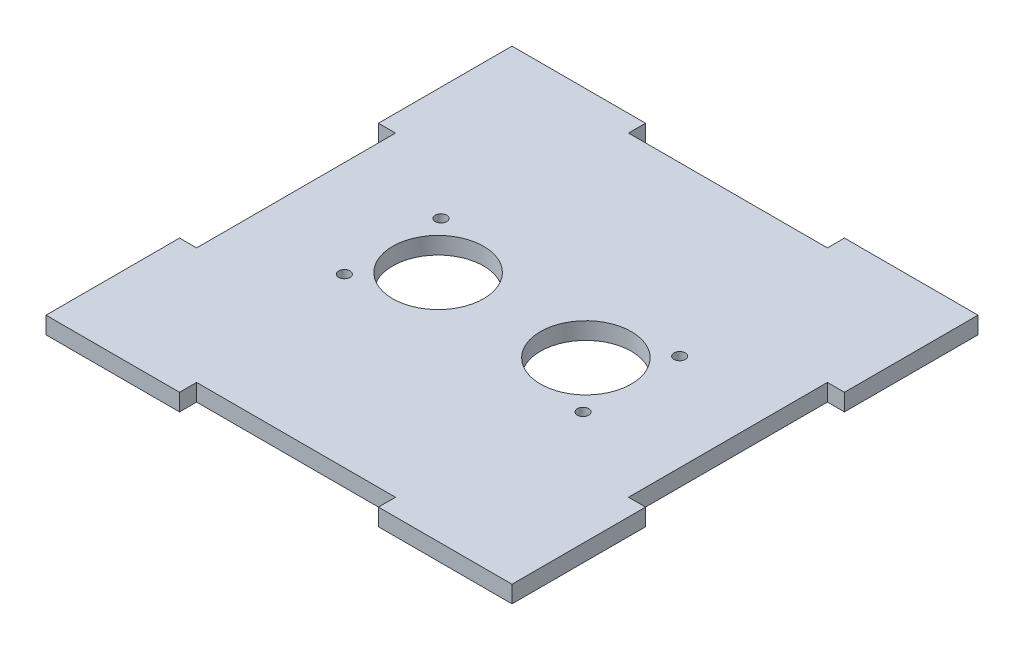
ISO-10303-21;
HEADER;
FILE_DESCRIPTION(('STEP AP214'),'2;1');
FILE_NAME('part.step','',(''),(''),'','','');
FILE_SCHEMA(('AUTOMOTIVE_DESIGN { 1 0 10303 214 1 1 1 1 }'));
ENDSEC;
DATA;
#1=APPLICATION_CONTEXT('core data for automotive mechanical design processes');
#2=APPLICATION_PROTOCOL_DEFINITION('international standard','automotive_design',2000,#1);
#3=PRODUCT_CONTEXT('',#1,'mechanical');
#4=PRODUCT('Part','Part','',(#3));
#5=PRODUCT_RELATED_PRODUCT_CATEGORY('part','',(#4));
#6=PRODUCT_DEFINITION_FORMATION('','',#4);
#7=PRODUCT_DEFINITION_CONTEXT('part definition',#1,'design');
#8=PRODUCT_DEFINITION('design','',#6,#7);
#9=PRODUCT_DEFINITION_SHAPE('','',#8);
#10=(LENGTH_UNIT() NAMED_UNIT(*) SI_UNIT(.MILLI.,.METRE.));
#11=(NAMED_UNIT(*) PLANE_ANGLE_UNIT() SI_UNIT($,.RADIAN.));
#12=(NAMED_UNIT(*) SI_UNIT($,.STERADIAN.) SOLID_ANGLE_UNIT());
#13=UNCERTAINTY_MEASURE_WITH_UNIT(LENGTH_MEASURE(1.E-05),#10,'distance_accuracy_value','');
#14=(GEOMETRIC_REPRESENTATION_CONTEXT(3) GLOBAL_UNCERTAINTY_ASSIGNED_CONTEXT((#13)) GLOBAL_UNIT_ASSIGNED_CONTEXT((#10,
#11,#12)) REPRESENTATION_CONTEXT('',''));
#15=CARTESIAN_POINT('',(0.,0.,0.));
#16=DIRECTION('',(0.,0.,1.));
#17=DIRECTION('',(1.,0.,0.));
#18=AXIS2_PLACEMENT_3D('',#15,#16,#17);
#19=CARTESIAN_POINT('',(41.,3.,-17.5));
#20=DIRECTION('',(-1.,0.,0.));
#21=DIRECTION('',(0.,0.,1.));
#22=AXIS2_PLACEMENT_3D('',#19,#20,#21);
#23=PLANE('',#22);
#24=DIRECTION('',(0.,0.,-1.));
#25=VECTOR('',#24,1.);
#26=CARTESIAN_POINT('',(41.,0.,-17.5));
#27=LINE('',#26,#25);
#28=CARTESIAN_POINT('',(41.,0.,-17.5));
#29=VERTEX_POINT('',#28);
#30=CARTESIAN_POINT('',(41.,0.,-41.));
#31=VERTEX_POINT('',#30);
#32=EDGE_CURVE('E204',#29,#31,#27,.T.);
#33=ORIENTED_EDGE('',*,*,#32,.T.);
#34=DIRECTION('',(0.,-1.,0.));
#35=VECTOR('',#34,1.);
#36=CARTESIAN_POINT('',(41.,3.,-41.));
#37=LINE('',#36,#35);
#38=CARTESIAN_POINT('',(41.,3.,-41.));
#39=VERTEX_POINT('',#38);
#40=EDGE_CURVE('E11',#39,#31,#37,.T.);
#41=ORIENTED_EDGE('',*,*,#40,.F.);
#42=DIRECTION('',(0.,0.,-1.));
#43=VECTOR('',#42,1.);
#44=CARTESIAN_POINT('',(41.,3.,-17.5));
#45=LINE('',#44,#43);
#46=CARTESIAN_POINT('',(41.,3.,-17.5));
#47=VERTEX_POINT('',#46);
#48=EDGE_CURVE('E243',#47,#39,#45,.T.);
#49=ORIENTED_EDGE('',*,*,#48,.F.);
#50=DIRECTION('',(0.,-1.,0.));
#51=VECTOR('',#50,1.);
#52=CARTESIAN_POINT('',(41.,3.,-17.5));
#53=LINE('',#52,#51);
#54=EDGE_CURVE('E200',#47,#29,#53,.T.);
#55=ORIENTED_EDGE('',*,*,#54,.T.);
#56=EDGE_LOOP('',(#33,#41,#49,#55));
#57=FACE_BOUND('',#56,.T.);
#58=ADVANCED_FACE('F36',(#57),#23,.F.);
#59=CARTESIAN_POINT('',(17.5,3.,-41.));
#60=DIRECTION('',(0.,0.,1.));
#61=DIRECTION('',(1.,0.,0.));
#62=AXIS2_PLACEMENT_3D('',#59,#60,#61);
#63=PLANE('',#62);
#64=DIRECTION('',(-1.,0.,0.));
#65=VECTOR('',#64,1.);
#66=CARTESIAN_POINT('',(17.5,0.,-41.));
#67=LINE('',#66,#65);
#68=CARTESIAN_POINT('',(17.5,0.,-41.));
#69=VERTEX_POINT('',#68);
#70=EDGE_CURVE('E207',#31,#69,#67,.T.);
#71=ORIENTED_EDGE('',*,*,#70,.T.);
#72=DIRECTION('',(0.,-1.,0.));
#73=VECTOR('',#72,1.);
#74=CARTESIAN_POINT('',(17.5,3.,-41.));
#75=LINE('',#74,#73);
#76=CARTESIAN_POINT('',(17.5,3.,-41.));
#77=VERTEX_POINT('',#76);
#78=EDGE_CURVE('E44',#77,#69,#75,.T.);
#79=ORIENTED_EDGE('',*,*,#78,.F.);
#80=DIRECTION('',(-1.,0.,0.));
#81=VECTOR('',#80,1.);
#82=CARTESIAN_POINT('',(17.5,3.,-41.));
#83=LINE('',#82,#81);
#84=EDGE_CURVE('E131',#39,#77,#83,.T.);
#85=ORIENTED_EDGE('',*,*,#84,.F.);
#86=ORIENTED_EDGE('',*,*,#40,.T.);
#87=EDGE_LOOP('',(#71,#79,#85,#86));
#88=FACE_BOUND('',#87,.T.);
#89=ADVANCED_FACE('F362',(#88),#63,.F.);
#90=CARTESIAN_POINT('',(17.5,3.,-38.));
#91=DIRECTION('',(1.,0.,0.));
#92=DIRECTION('',(0.,0.,-1.));
#93=AXIS2_PLACEMENT_3D('',#90,#91,#92);
#94=PLANE('',#93);
#95=DIRECTION('',(0.,0.,1.));
#96=VECTOR('',#95,1.);
#97=CARTESIAN_POINT('',(17.5,0.,-38.));
#98=LINE('',#97,#96);
#99=CARTESIAN_POINT('',(17.5,0.,-38.));
#100=VERTEX_POINT('',#99);
#101=EDGE_CURVE('E210',#69,#100,#98,.T.);
#102=ORIENTED_EDGE('',*,*,#101,.T.);
#103=DIRECTION('',(0.,-1.,0.));
#104=VECTOR('',#103,1.);
#105=CARTESIAN_POINT('',(17.5,3.,-38.));
#106=LINE('',#105,#104);
#107=CARTESIAN_POINT('',(17.5,3.,-38.));
#108=VERTEX_POINT('',#107);
#109=EDGE_CURVE('E286',#108,#100,#106,.T.);
#110=ORIENTED_EDGE('',*,*,#109,.F.);
#111=DIRECTION('',(0.,0.,1.));
#112=VECTOR('',#111,1.);
#113=CARTESIAN_POINT('',(17.5,3.,-38.));
#114=LINE('',#113,#112);
#115=EDGE_CURVE('E294',#77,#108,#114,.T.);
#116=ORIENTED_EDGE('',*,*,#115,.F.);
#117=ORIENTED_EDGE('',*,*,#78,.T.);
#118=EDGE_LOOP('',(#102,#110,#116,#117));
#119=FACE_BOUND('',#118,.T.);
#120=ADVANCED_FACE('F292',(#119),#94,.F.);
#121=CARTESIAN_POINT('',(-17.5,3.,-38.));
#122=DIRECTION('',(0.,0.,1.));
#123=DIRECTION('',(1.,0.,0.));
#124=AXIS2_PLACEMENT_3D('',#121,#122,#123);
#125=PLANE('',#124);
#126=DIRECTION('',(-1.,0.,0.));
#127=VECTOR('',#126,1.);
#128=CARTESIAN_POINT('',(-17.5,0.,-38.));
#129=LINE('',#128,#127);
#130=CARTESIAN_POINT('',(-17.5,0.,-38.));
#131=VERTEX_POINT('',#130);
#132=EDGE_CURVE('E212',#100,#131,#129,.T.);
#133=ORIENTED_EDGE('',*,*,#132,.T.);
#134=DIRECTION('',(0.,-1.,0.));
#135=VECTOR('',#134,1.);
#136=CARTESIAN_POINT('',(-17.5,3.,-38.));
#137=LINE('',#136,#135);
#138=CARTESIAN_POINT('',(-17.5,3.,-38.));
#139=VERTEX_POINT('',#138);
#140=EDGE_CURVE('E283',#139,#131,#137,.T.);
#141=ORIENTED_EDGE('',*,*,#140,.F.);
#142=DIRECTION('',(-1.,0.,0.));
#143=VECTOR('',#142,1.);
#144=CARTESIAN_POINT('',(-17.5,3.,-38.));
#145=LINE('',#144,#143);
#146=EDGE_CURVE('E312',#108,#139,#145,.T.);
#147=ORIENTED_EDGE('',*,*,#146,.F.);
#148=ORIENTED_EDGE('',*,*,#109,.T.);
#149=EDGE_LOOP('',(#133,#141,#147,#148));
#150=FACE_BOUND('',#149,.T.);
#151=ADVANCED_FACE('F303',(#150),#125,.F.);
#152=CARTESIAN_POINT('',(-17.5,3.,-41.));
#153=DIRECTION('',(-1.,0.,0.));
#154=DIRECTION('',(0.,0.,1.));
#155=AXIS2_PLACEMENT_3D('',#152,#153,#154);
#156=PLANE('',#155);
#157=DIRECTION('',(0.,0.,-1.));
#158=VECTOR('',#157,1.);
#159=CARTESIAN_POINT('',(-17.5,0.,-41.));
#160=LINE('',#159,#158);
#161=CARTESIAN_POINT('',(-17.5,0.,-41.));
#162=VERTEX_POINT('',#161);
#163=EDGE_CURVE('E214',#131,#162,#160,.T.);
#164=ORIENTED_EDGE('',*,*,#163,.T.);
#165=DIRECTION('',(0.,-1.,0.));
#166=VECTOR('',#165,1.);
#167=CARTESIAN_POINT('',(-17.5,3.,-41.));
#168=LINE('',#167,#166);
#169=CARTESIAN_POINT('',(-17.5,3.,-41.));
#170=VERTEX_POINT('',#169);
#171=EDGE_CURVE('E280',#170,#162,#168,.T.);
#172=ORIENTED_EDGE('',*,*,#171,.F.);
#173=DIRECTION('',(0.,0.,-1.));
#174=VECTOR('',#173,1.);
#175=CARTESIAN_POINT('',(-17.5,3.,-41.));
#176=LINE('',#175,#174);
#177=EDGE_CURVE('E309',#139,#170,#176,.T.);
#178=ORIENTED_EDGE('',*,*,#177,.F.);
#179=ORIENTED_EDGE('',*,*,#140,.T.);
#180=EDGE_LOOP('',(#164,#172,#178,#179));
#181=FACE_BOUND('',#180,.T.);
#182=ADVANCED_FACE('F307',(#181),#156,.F.);
#183=CARTESIAN_POINT('',(-41.,3.,-41.));
#184=DIRECTION('',(0.,0.,1.));
#185=DIRECTION('',(1.,0.,0.));
#186=AXIS2_PLACEMENT_3D('',#183,#184,#185);
#187=PLANE('',#186);
#188=DIRECTION('',(-1.,0.,0.));
#189=VECTOR('',#188,1.);
#190=CARTESIAN_POINT('',(-41.,0.,-41.));
#191=LINE('',#190,#189);
#192=CARTESIAN_POINT('',(-41.,0.,-41.));
#193=VERTEX_POINT('',#192);
#194=EDGE_CURVE('E216',#162,#193,#191,.T.);
#195=ORIENTED_EDGE('',*,*,#194,.T.);
#196=DIRECTION('',(0.,-1.,0.));
#197=VECTOR('',#196,1.);
#198=CARTESIAN_POINT('',(-41.,3.,-41.));
#199=LINE('',#198,#197);
#200=CARTESIAN_POINT('',(-41.,3.,-41.));
#201=VERTEX_POINT('',#200);
#202=EDGE_CURVE('E277',#201,#193,#199,.T.);
#203=ORIENTED_EDGE('',*,*,#202,.F.);
#204=DIRECTION('',(-1.,0.,0.));
#205=VECTOR('',#204,1.);
#206=CARTESIAN_POINT('',(-41.,3.,-41.));
#207=LINE('',#206,#205);
#208=EDGE_CURVE('E311',#170,#201,#207,.T.);
#209=ORIENTED_EDGE('',*,*,#208,.F.);
#210=ORIENTED_EDGE('',*,*,#171,.T.);
#211=EDGE_LOOP('',(#195,#203,#209,#210));
#212=FACE_BOUND('',#211,.T.);
#213=ADVANCED_FACE('F375',(#212),#187,.F.);
#214=CARTESIAN_POINT('',(-41.,3.,-17.5));
#215=DIRECTION('',(1.,0.,0.));
#216=DIRECTION('',(0.,0.,-1.));
#217=AXIS2_PLACEMENT_3D('',#214,#215,#216);
#218=PLANE('',#217);
#219=DIRECTION('',(0.,0.,1.));
#220=VECTOR('',#219,1.);
#221=CARTESIAN_POINT('',(-41.,0.,-17.5));
#222=LINE('',#221,#220);
#223=CARTESIAN_POINT('',(-41.,0.,-17.5));
#224=VERTEX_POINT('',#223);
#225=EDGE_CURVE('E218',#193,#224,#222,.T.);
#226=ORIENTED_EDGE('',*,*,#225,.T.);
#227=DIRECTION('',(0.,-1.,0.));
#228=VECTOR('',#227,1.);
#229=CARTESIAN_POINT('',(-41.,3.,-17.5));
#230=LINE('',#229,#228);
#231=CARTESIAN_POINT('',(-41.,3.,-17.5));
#232=VERTEX_POINT('',#231);
#233=EDGE_CURVE('E274',#232,#224,#230,.T.);
#234=ORIENTED_EDGE('',*,*,#233,.F.);
#235=DIRECTION('',(0.,0.,1.));
#236=VECTOR('',#235,1.);
#237=CARTESIAN_POINT('',(-41.,3.,-17.5));
#238=LINE('',#237,#236);
#239=EDGE_CURVE('E314',#201,#232,#238,.T.);
#240=ORIENTED_EDGE('',*,*,#239,.F.);
#241=ORIENTED_EDGE('',*,*,#202,.T.);
#242=EDGE_LOOP('',(#226,#234,#240,#241));
#243=FACE_BOUND('',#242,.T.);
#244=ADVANCED_FACE('F378',(#243),#218,.F.);
#245=CARTESIAN_POINT('',(-41.,3.,-17.5));
#246=DIRECTION('',(0.,0.,-1.));
#247=DIRECTION('',(-1.,0.,0.));
#248=AXIS2_PLACEMENT_3D('',#245,#246,#247);
#249=PLANE('',#248);
#250=DIRECTION('',(1.,0.,0.));
#251=VECTOR('',#250,1.);
#252=CARTESIAN_POINT('',(-41.,0.,-17.5));
#253=LINE('',#252,#251);
#254=CARTESIAN_POINT('',(-38.,0.,-17.5));
#255=VERTEX_POINT('',#254);
#256=EDGE_CURVE('E220',#224,#255,#253,.T.);
#257=ORIENTED_EDGE('',*,*,#256,.T.);
#258=DIRECTION('',(0.,-1.,0.));
#259=VECTOR('',#258,1.);
#260=CARTESIAN_POINT('',(-38.,3.,-17.5));
#261=LINE('',#260,#259);
#262=CARTESIAN_POINT('',(-38.,3.,-17.5));
#263=VERTEX_POINT('',#262);
#264=EDGE_CURVE('E271',#263,#255,#261,.T.);
#265=ORIENTED_EDGE('',*,*,#264,.F.);
#266=DIRECTION('',(1.,0.,0.));
#267=VECTOR('',#266,1.);
#268=CARTESIAN_POINT('',(-41.,3.,-17.5));
#269=LINE('',#268,#267);
#270=EDGE_CURVE('E320',#232,#263,#269,.T.);
#271=ORIENTED_EDGE('',*,*,#270,.F.);
#272=ORIENTED_EDGE('',*,*,#233,.T.);
#273=EDGE_LOOP('',(#257,#265,#271,#272));
#274=FACE_BOUND('',#273,.T.);
#275=ADVANCED_FACE('F382',(#274),#249,.F.);
#276=CARTESIAN_POINT('',(-38.,3.,-17.5));
#277=DIRECTION('',(1.,0.,0.));
#278=DIRECTION('',(0.,0.,-1.));
#279=AXIS2_PLACEMENT_3D('',#276,#277,#278);
#280=PLANE('',#279);
#281=DIRECTION('',(0.,0.,1.));
#282=VECTOR('',#281,1.);
#283=CARTESIAN_POINT('',(-38.,0.,-17.5));
#284=LINE('',#283,#282);
#285=CARTESIAN_POINT('',(-38.,0.,17.5));
#286=VERTEX_POINT('',#285);
#287=EDGE_CURVE('E222',#255,#286,#284,.T.);
#288=ORIENTED_EDGE('',*,*,#287,.T.);
#289=DIRECTION('',(0.,-1.,0.));
#290=VECTOR('',#289,1.);
#291=CARTESIAN_POINT('',(-38.,3.,17.5));
#292=LINE('',#291,#290);
#293=CARTESIAN_POINT('',(-38.,3.,17.5));
#294=VERTEX_POINT('',#293);
#295=EDGE_CURVE('E268',#294,#286,#292,.T.);
#296=ORIENTED_EDGE('',*,*,#295,.F.);
#297=DIRECTION('',(0.,0.,1.));
#298=VECTOR('',#297,1.);
#299=CARTESIAN_POINT('',(-38.,3.,-17.5));
#300=LINE('',#299,#298);
#301=EDGE_CURVE('E322',#263,#294,#300,.T.);
#302=ORIENTED_EDGE('',*,*,#301,.F.);
#303=ORIENTED_EDGE('',*,*,#264,.T.);
#304=EDGE_LOOP('',(#288,#296,#302,#303));
#305=FACE_BOUND('',#304,.T.);
#306=ADVANCED_FACE('F386',(#305),#280,.F.);
#307=CARTESIAN_POINT('',(-38.,3.,17.5));
#308=DIRECTION('',(0.,0.,1.));
#309=DIRECTION('',(1.,0.,0.));
#310=AXIS2_PLACEMENT_3D('',#307,#308,#309);
#311=PLANE('',#310);
#312=DIRECTION('',(-1.,0.,0.));
#313=VECTOR('',#312,1.);
#314=CARTESIAN_POINT('',(-38.,0.,17.5));
#315=LINE('',#314,#313);
#316=CARTESIAN_POINT('',(-41.,0.,17.5));
#317=VERTEX_POINT('',#316);
#318=EDGE_CURVE('E224',#286,#317,#315,.T.);
#319=ORIENTED_EDGE('',*,*,#318,.T.);
#320=DIRECTION('',(0.,-1.,0.));
#321=VECTOR('',#320,1.);
#322=CARTESIAN_POINT('',(-41.,3.,17.5));
#323=LINE('',#322,#321);
#324=CARTESIAN_POINT('',(-41.,3.,17.5));
#325=VERTEX_POINT('',#324);
#326=EDGE_CURVE('E265',#325,#317,#323,.T.);
#327=ORIENTED_EDGE('',*,*,#326,.F.);
#328=DIRECTION('',(-1.,0.,0.));
#329=VECTOR('',#328,1.);
#330=CARTESIAN_POINT('',(-38.,3.,17.5));
#331=LINE('',#330,#329);
#332=EDGE_CURVE('E324',#294,#325,#331,.T.);
#333=ORIENTED_EDGE('',*,*,#332,.F.);
#334=ORIENTED_EDGE('',*,*,#295,.T.);
#335=EDGE_LOOP('',(#319,#327,#333,#334));
#336=FACE_BOUND('',#335,.T.);
#337=ADVANCED_FACE('F390',(#336),#311,.F.);
#338=CARTESIAN_POINT('',(-41.,3.,41.));
#339=DIRECTION('',(1.,0.,0.));
#340=DIRECTION('',(0.,0.,-1.));
#341=AXIS2_PLACEMENT_3D('',#338,#339,#340);
#342=PLANE('',#341);
#343=DIRECTION('',(0.,0.,1.));
#344=VECTOR('',#343,1.);
#345=CARTESIAN_POINT('',(-41.,0.,41.));
#346=LINE('',#345,#344);
#347=CARTESIAN_POINT('',(-41.,0.,41.));
#348=VERTEX_POINT('',#347);
#349=EDGE_CURVE('E226',#317,#348,#346,.T.);
#350=ORIENTED_EDGE('',*,*,#349,.T.);
#351=DIRECTION('',(0.,-1.,0.));
#352=VECTOR('',#351,1.);
#353=CARTESIAN_POINT('',(-41.,3.,41.));
#354=LINE('',#353,#352);
#355=CARTESIAN_POINT('',(-41.,3.,41.));
#356=VERTEX_POINT('',#355);
#357=EDGE_CURVE('E262',#356,#348,#354,.T.);
#358=ORIENTED_EDGE('',*,*,#357,.F.);
#359=DIRECTION('',(0.,0.,1.));
#360=VECTOR('',#359,1.);
#361=CARTESIAN_POINT('',(-41.,3.,41.));
#362=LINE('',#361,#360);
#363=EDGE_CURVE('E326',#325,#356,#362,.T.);
#364=ORIENTED_EDGE('',*,*,#363,.F.);
#365=ORIENTED_EDGE('',*,*,#326,.T.);
#366=EDGE_LOOP('',(#350,#358,#364,#365));
#367=FACE_BOUND('',#366,.T.);
#368=ADVANCED_FACE('F394',(#367),#342,.F.);
#369=CARTESIAN_POINT('',(-41.,3.,41.));
#370=DIRECTION('',(0.,0.,-1.));
#371=DIRECTION('',(-1.,0.,0.));
#372=AXIS2_PLACEMENT_3D('',#369,#370,#371);
#373=PLANE('',#372);
#374=DIRECTION('',(1.,0.,0.));
#375=VECTOR('',#374,1.);
#376=CARTESIAN_POINT('',(-41.,0.,41.));
#377=LINE('',#376,#375);
#378=CARTESIAN_POINT('',(-17.5,0.,41.));
#379=VERTEX_POINT('',#378);
#380=EDGE_CURVE('E228',#348,#379,#377,.T.);
#381=ORIENTED_EDGE('',*,*,#380,.T.);
#382=DIRECTION('',(0.,-1.,0.));
#383=VECTOR('',#382,1.);
#384=CARTESIAN_POINT('',(-17.5,3.,41.));
#385=LINE('',#384,#383);
#386=CARTESIAN_POINT('',(-17.5,3.,41.));
#387=VERTEX_POINT('',#386);
#388=EDGE_CURVE('E259',#387,#379,#385,.T.);
#389=ORIENTED_EDGE('',*,*,#388,.F.);
#390=DIRECTION('',(1.,0.,0.));
#391=VECTOR('',#390,1.);
#392=CARTESIAN_POINT('',(-41.,3.,41.));
#393=LINE('',#392,#391);
#394=EDGE_CURVE('E328',#356,#387,#393,.T.);
#395=ORIENTED_EDGE('',*,*,#394,.F.);
#396=ORIENTED_EDGE('',*,*,#357,.T.);
#397=EDGE_LOOP('',(#381,#389,#395,#396));
#398=FACE_BOUND('',#397,.T.);
#399=ADVANCED_FACE('F398',(#398),#373,.F.);
#400=CARTESIAN_POINT('',(-17.5,3.,38.));
#401=DIRECTION('',(-1.,0.,0.));
#402=DIRECTION('',(0.,0.,1.));
#403=AXIS2_PLACEMENT_3D('',#400,#401,#402);
#404=PLANE('',#403);
#405=DIRECTION('',(0.,0.,-1.));
#406=VECTOR('',#405,1.);
#407=CARTESIAN_POINT('',(-17.5,0.,38.));
#408=LINE('',#407,#406);
#409=CARTESIAN_POINT('',(-17.5,0.,38.));
#410=VERTEX_POINT('',#409);
#411=EDGE_CURVE('E230',#379,#410,#408,.T.);
#412=ORIENTED_EDGE('',*,*,#411,.T.);
#413=DIRECTION('',(0.,-1.,0.));
#414=VECTOR('',#413,1.);
#415=CARTESIAN_POINT('',(-17.5,3.,38.));
#416=LINE('',#415,#414);
#417=CARTESIAN_POINT('',(-17.5,3.,38.));
#418=VERTEX_POINT('',#417);
#419=EDGE_CURVE('E256',#418,#410,#416,.T.);
#420=ORIENTED_EDGE('',*,*,#419,.F.);
#421=DIRECTION('',(0.,0.,-1.));
#422=VECTOR('',#421,1.);
#423=CARTESIAN_POINT('',(-17.5,3.,38.));
#424=LINE('',#423,#422);
#425=EDGE_CURVE('E330',#387,#418,#424,.T.);
#426=ORIENTED_EDGE('',*,*,#425,.F.);
#427=ORIENTED_EDGE('',*,*,#388,.T.);
#428=EDGE_LOOP('',(#412,#420,#426,#427));
#429=FACE_BOUND('',#428,.T.);
#430=ADVANCED_FACE('F402',(#429),#404,.F.);
#431=CARTESIAN_POINT('',(17.5,3.,38.));
#432=DIRECTION('',(0.,0.,-1.));
#433=DIRECTION('',(-1.,0.,0.));
#434=AXIS2_PLACEMENT_3D('',#431,#432,#433);
#435=PLANE('',#434);
#436=DIRECTION('',(1.,0.,0.));
#437=VECTOR('',#436,1.);
#438=CARTESIAN_POINT('',(17.5,0.,38.));
#439=LINE('',#438,#437);
#440=CARTESIAN_POINT('',(17.5,0.,38.));
#441=VERTEX_POINT('',#440);
#442=EDGE_CURVE('E232',#410,#441,#439,.T.);
#443=ORIENTED_EDGE('',*,*,#442,.T.);
#444=DIRECTION('',(0.,-1.,0.));
#445=VECTOR('',#444,1.);
#446=CARTESIAN_POINT('',(17.5,3.,38.));
#447=LINE('',#446,#445);
#448=CARTESIAN_POINT('',(17.5,3.,38.));
#449=VERTEX_POINT('',#448);
#450=EDGE_CURVE('E253',#449,#441,#447,.T.);
#451=ORIENTED_EDGE('',*,*,#450,.F.);
#452=DIRECTION('',(1.,0.,0.));
#453=VECTOR('',#452,1.);
#454=CARTESIAN_POINT('',(17.5,3.,38.));
#455=LINE('',#454,#453);
#456=EDGE_CURVE('E332',#418,#449,#455,.T.);
#457=ORIENTED_EDGE('',*,*,#456,.F.);
#458=ORIENTED_EDGE('',*,*,#419,.T.);
#459=EDGE_LOOP('',(#443,#451,#457,#458));
#460=FACE_BOUND('',#459,.T.);
#461=ADVANCED_FACE('F406',(#460),#435,.F.);
#462=CARTESIAN_POINT('',(17.5,3.,41.));
#463=DIRECTION('',(1.,0.,0.));
#464=DIRECTION('',(0.,0.,-1.));
#465=AXIS2_PLACEMENT_3D('',#462,#463,#464);
#466=PLANE('',#465);
#467=DIRECTION('',(0.,0.,1.));
#468=VECTOR('',#467,1.);
#469=CARTESIAN_POINT('',(17.5,0.,41.));
#470=LINE('',#469,#468);
#471=CARTESIAN_POINT('',(17.5,0.,41.));
#472=VERTEX_POINT('',#471);
#473=EDGE_CURVE('E234',#441,#472,#470,.T.);
#474=ORIENTED_EDGE('',*,*,#473,.T.);
#475=DIRECTION('',(0.,-1.,0.));
#476=VECTOR('',#475,1.);
#477=CARTESIAN_POINT('',(17.5,3.,41.));
#478=LINE('',#477,#476);
#479=CARTESIAN_POINT('',(17.5,3.,41.));
#480=VERTEX_POINT('',#479);
#481=EDGE_CURVE('E250',#480,#472,#478,.T.);
#482=ORIENTED_EDGE('',*,*,#481,.F.);
#483=DIRECTION('',(0.,0.,1.));
#484=VECTOR('',#483,1.);
#485=CARTESIAN_POINT('',(17.5,3.,41.));
#486=LINE('',#485,#484);
#487=EDGE_CURVE('E334',#449,#480,#486,.T.);
#488=ORIENTED_EDGE('',*,*,#487,.F.);
#489=ORIENTED_EDGE('',*,*,#450,.T.);
#490=EDGE_LOOP('',(#474,#482,#488,#489));
#491=FACE_BOUND('',#490,.T.);
#492=ADVANCED_FACE('F410',(#491),#466,.F.);
#493=CARTESIAN_POINT('',(17.5,3.,41.));
#494=DIRECTION('',(0.,0.,-1.));
#495=DIRECTION('',(-1.,0.,0.));
#496=AXIS2_PLACEMENT_3D('',#493,#494,#495);
#497=PLANE('',#496);
#498=DIRECTION('',(1.,0.,0.));
#499=VECTOR('',#498,1.);
#500=CARTESIAN_POINT('',(17.5,0.,41.));
#501=LINE('',#500,#499);
#502=CARTESIAN_POINT('',(41.,0.,41.));
#503=VERTEX_POINT('',#502);
#504=EDGE_CURVE('E236',#472,#503,#501,.T.);
#505=ORIENTED_EDGE('',*,*,#504,.T.);
#506=DIRECTION('',(0.,-1.,0.));
#507=VECTOR('',#506,1.);
#508=CARTESIAN_POINT('',(41.,3.,41.));
#509=LINE('',#508,#507);
#510=CARTESIAN_POINT('',(41.,3.,41.));
#511=VERTEX_POINT('',#510);
#512=EDGE_CURVE('E247',#511,#503,#509,.T.);
#513=ORIENTED_EDGE('',*,*,#512,.F.);
#514=DIRECTION('',(1.,0.,0.));
#515=VECTOR('',#514,1.);
#516=CARTESIAN_POINT('',(17.5,3.,41.));
#517=LINE('',#516,#515);
#518=EDGE_CURVE('E336',#480,#511,#517,.T.);
#519=ORIENTED_EDGE('',*,*,#518,.F.);
#520=ORIENTED_EDGE('',*,*,#481,.T.);
#521=EDGE_LOOP('',(#505,#513,#519,#520));
#522=FACE_BOUND('',#521,.T.);
#523=ADVANCED_FACE('F342',(#522),#497,.F.);
#524=CARTESIAN_POINT('',(41.,3.,41.));
#525=DIRECTION('',(-1.,0.,0.));
#526=DIRECTION('',(0.,0.,1.));
#527=AXIS2_PLACEMENT_3D('',#524,#525,#526);
#528=PLANE('',#527);
#529=DIRECTION('',(0.,0.,-1.));
#530=VECTOR('',#529,1.);
#531=CARTESIAN_POINT('',(41.,0.,41.));
#532=LINE('',#531,#530);
#533=CARTESIAN_POINT('',(41.,0.,17.5));
#534=VERTEX_POINT('',#533);
#535=EDGE_CURVE('E238',#503,#534,#532,.T.);
#536=ORIENTED_EDGE('',*,*,#535,.T.);
#537=DIRECTION('',(0.,-1.,0.));
#538=VECTOR('',#537,1.);
#539=CARTESIAN_POINT('',(41.,3.,17.5));
#540=LINE('',#539,#538);
#541=CARTESIAN_POINT('',(41.,3.,17.5));
#542=VERTEX_POINT('',#541);
#543=EDGE_CURVE('E195',#542,#534,#540,.T.);
#544=ORIENTED_EDGE('',*,*,#543,.F.);
#545=DIRECTION('',(0.,0.,-1.));
#546=VECTOR('',#545,1.);
#547=CARTESIAN_POINT('',(41.,3.,41.));
#548=LINE('',#547,#546);
#549=EDGE_CURVE('E186',#511,#542,#548,.T.);
#550=ORIENTED_EDGE('',*,*,#549,.F.);
#551=ORIENTED_EDGE('',*,*,#512,.T.);
#552=EDGE_LOOP('',(#536,#544,#550,#551));
#553=FACE_BOUND('',#552,.T.);
#554=ADVANCED_FACE('F346',(#553),#528,.F.);
#555=CARTESIAN_POINT('',(38.,3.,17.5));
#556=DIRECTION('',(0.,0.,1.));
#557=DIRECTION('',(1.,0.,0.));
#558=AXIS2_PLACEMENT_3D('',#555,#556,#557);
#559=PLANE('',#558);
#560=DIRECTION('',(-1.,0.,0.));
#561=VECTOR('',#560,1.);
#562=CARTESIAN_POINT('',(38.,0.,17.5));
#563=LINE('',#562,#561);
#564=CARTESIAN_POINT('',(38.,0.,17.5));
#565=VERTEX_POINT('',#564);
#566=EDGE_CURVE('E194',#534,#565,#563,.T.);
#567=ORIENTED_EDGE('',*,*,#566,.T.);
#568=DIRECTION('',(0.,-1.,0.));
#569=VECTOR('',#568,1.);
#570=CARTESIAN_POINT('',(38.,3.,17.5));
#571=LINE('',#570,#569);
#572=CARTESIAN_POINT('',(38.,3.,17.5));
#573=VERTEX_POINT('',#572);
#574=EDGE_CURVE('E191',#573,#565,#571,.T.);
#575=ORIENTED_EDGE('',*,*,#574,.F.);
#576=DIRECTION('',(-1.,0.,0.));
#577=VECTOR('',#576,1.);
#578=CARTESIAN_POINT('',(38.,3.,17.5));
#579=LINE('',#578,#577);
#580=EDGE_CURVE('E180',#542,#573,#579,.T.);
#581=ORIENTED_EDGE('',*,*,#580,.F.);
#582=ORIENTED_EDGE('',*,*,#543,.T.);
#583=EDGE_LOOP('',(#567,#575,#581,#582));
#584=FACE_BOUND('',#583,.T.);
#585=ADVANCED_FACE('F192',(#584),#559,.F.);
#586=CARTESIAN_POINT('',(38.,3.,-17.5));
#587=DIRECTION('',(-1.,0.,0.));
#588=DIRECTION('',(0.,0.,1.));
#589=AXIS2_PLACEMENT_3D('',#586,#587,#588);
#590=PLANE('',#589);
#591=DIRECTION('',(0.,0.,-1.));
#592=VECTOR('',#591,1.);
#593=CARTESIAN_POINT('',(38.,0.,-17.5));
#594=LINE('',#593,#592);
#595=CARTESIAN_POINT('',(38.,0.,-17.5));
#596=VERTEX_POINT('',#595);
#597=EDGE_CURVE('E117',#565,#596,#594,.T.);
#598=ORIENTED_EDGE('',*,*,#597,.T.);
#599=DIRECTION('',(0.,-1.,0.));
#600=VECTOR('',#599,1.);
#601=CARTESIAN_POINT('',(38.,3.,-17.5));
#602=LINE('',#601,#600);
#603=CARTESIAN_POINT('',(38.,3.,-17.5));
#604=VERTEX_POINT('',#603);
#605=EDGE_CURVE('E196',#604,#596,#602,.T.);
#606=ORIENTED_EDGE('',*,*,#605,.F.);
#607=DIRECTION('',(0.,0.,-1.));
#608=VECTOR('',#607,1.);
#609=CARTESIAN_POINT('',(38.,3.,-17.5));
#610=LINE('',#609,#608);
#611=EDGE_CURVE('E184',#573,#604,#610,.T.);
#612=ORIENTED_EDGE('',*,*,#611,.F.);
#613=ORIENTED_EDGE('',*,*,#574,.T.);
#614=EDGE_LOOP('',(#598,#606,#612,#613));
#615=FACE_BOUND('',#614,.T.);
#616=ADVANCED_FACE('F198',(#615),#590,.F.);
#617=CARTESIAN_POINT('',(41.,3.,-17.5));
#618=DIRECTION('',(0.,0.,-1.));
#619=DIRECTION('',(-1.,0.,0.));
#620=AXIS2_PLACEMENT_3D('',#617,#618,#619);
#621=PLANE('',#620);
#622=DIRECTION('',(1.,0.,0.));
#623=VECTOR('',#622,1.);
#624=CARTESIAN_POINT('',(41.,0.,-17.5));
#625=LINE('',#624,#623);
#626=EDGE_CURVE('E123',#596,#29,#625,.T.);
#627=ORIENTED_EDGE('',*,*,#626,.T.);
#628=ORIENTED_EDGE('',*,*,#54,.F.);
#629=DIRECTION('',(1.,0.,0.));
#630=VECTOR('',#629,1.);
#631=CARTESIAN_POINT('',(41.,3.,-17.5));
#632=LINE('',#631,#630);
#633=EDGE_CURVE('E52',#604,#47,#632,.T.);
#634=ORIENTED_EDGE('',*,*,#633,.F.);
#635=ORIENTED_EDGE('',*,*,#605,.T.);
#636=EDGE_LOOP('',(#627,#628,#634,#635));
#637=FACE_BOUND('',#636,.T.);
#638=ADVANCED_FACE('F350',(#637),#621,.F.);
#639=CARTESIAN_POINT('',(0.,3.,0.));
#640=DIRECTION('',(0.,-1.,0.));
#641=DIRECTION('',(0.,0.,-1.));
#642=AXIS2_PLACEMENT_3D('',#639,#640,#641);
#643=PLANE('',#642);
#644=CARTESIAN_POINT('',(-21.,3.,-8.5));
#645=DIRECTION('',(0.,1.,0.));
#646=DIRECTION('',(0.,0.,1.));
#647=AXIS2_PLACEMENT_3D('',#644,#645,#646);
#648=CIRCLE('',#647,1.);
#649=CARTESIAN_POINT('',(-21.,3.,-7.5));
#650=VERTEX_POINT('',#649);
#651=EDGE_CURVE('E516',#650,#650,#648,.T.);
#652=ORIENTED_EDGE('',*,*,#651,.F.);
#653=EDGE_LOOP('',(#652));
#654=FACE_BOUND('',#653,.T.);
#655=CARTESIAN_POINT('',(-21.,3.,8.5));
#656=DIRECTION('',(0.,1.,0.));
#657=DIRECTION('',(0.,0.,-1.));
#658=AXIS2_PLACEMENT_3D('',#655,#656,#657);
#659=CIRCLE('',#658,1.);
#660=CARTESIAN_POINT('',(-21.,3.,7.5));
#661=VERTEX_POINT('',#660);
#662=EDGE_CURVE('E522',#661,#661,#659,.T.);
#663=ORIENTED_EDGE('',*,*,#662,.F.);
#664=EDGE_LOOP('',(#663));
#665=FACE_BOUND('',#664,.T.);
#666=CARTESIAN_POINT('',(21.,3.,8.49999999999999));
#667=DIRECTION('',(0.,1.,0.));
#668=DIRECTION('',(0.,0.,1.));
#669=AXIS2_PLACEMENT_3D('',#666,#667,#668);
#670=CIRCLE('',#669,1.);
#671=CARTESIAN_POINT('',(21.,3.,9.49999999999999));
#672=VERTEX_POINT('',#671);
#673=EDGE_CURVE('E531',#672,#672,#670,.T.);
#674=ORIENTED_EDGE('',*,*,#673,.F.);
#675=EDGE_LOOP('',(#674));
#676=FACE_BOUND('',#675,.T.);
#677=CARTESIAN_POINT('',(21.,3.,-8.5));
#678=DIRECTION('',(0.,1.,0.));
#679=DIRECTION('',(0.,0.,-1.));
#680=AXIS2_PLACEMENT_3D('',#677,#678,#679);
#681=CIRCLE('',#680,1.);
#682=CARTESIAN_POINT('',(21.,3.,-9.50000000000001));
#683=VERTEX_POINT('',#682);
#684=EDGE_CURVE('E537',#683,#683,#681,.T.);
#685=ORIENTED_EDGE('',*,*,#684,.F.);
#686=EDGE_LOOP('',(#685));
#687=FACE_BOUND('',#686,.T.);
#688=CARTESIAN_POINT('',(13.,3.,0.));
#689=DIRECTION('',(0.,1.,0.));
#690=DIRECTION('',(0.,0.,-1.));
#691=AXIS2_PLACEMENT_3D('',#688,#689,#690);
#692=CIRCLE('',#691,8.);
#693=CARTESIAN_POINT('',(13.,3.,-8.));
#694=VERTEX_POINT('',#693);
#695=EDGE_CURVE('E554',#694,#694,#692,.T.);
#696=ORIENTED_EDGE('',*,*,#695,.F.);
#697=EDGE_LOOP('',(#696));
#698=FACE_BOUND('',#697,.T.);
#699=CARTESIAN_POINT('',(-13.,3.,0.));
#700=DIRECTION('',(0.,1.,0.));
#701=DIRECTION('',(0.,0.,1.));
#702=AXIS2_PLACEMENT_3D('',#699,#700,#701);
#703=CIRCLE('',#702,8.);
#704=CARTESIAN_POINT('',(-13.,3.,8.));
#705=VERTEX_POINT('',#704);
#706=EDGE_CURVE('E519',#705,#705,#703,.T.);
#707=ORIENTED_EDGE('',*,*,#706,.F.);
#708=EDGE_LOOP('',(#707));
#709=FACE_BOUND('',#708,.T.);
#710=ORIENTED_EDGE('',*,*,#48,.T.);
#711=ORIENTED_EDGE('',*,*,#84,.T.);
#712=ORIENTED_EDGE('',*,*,#115,.T.);
#713=ORIENTED_EDGE('',*,*,#146,.T.);
#714=ORIENTED_EDGE('',*,*,#177,.T.);
#715=ORIENTED_EDGE('',*,*,#208,.T.);
#716=ORIENTED_EDGE('',*,*,#239,.T.);
#717=ORIENTED_EDGE('',*,*,#270,.T.);
#718=ORIENTED_EDGE('',*,*,#301,.T.);
#719=ORIENTED_EDGE('',*,*,#332,.T.);
#720=ORIENTED_EDGE('',*,*,#363,.T.);
#721=ORIENTED_EDGE('',*,*,#394,.T.);
#722=ORIENTED_EDGE('',*,*,#425,.T.);
#723=ORIENTED_EDGE('',*,*,#456,.T.);
#724=ORIENTED_EDGE('',*,*,#487,.T.);
#725=ORIENTED_EDGE('',*,*,#518,.T.);
#726=ORIENTED_EDGE('',*,*,#549,.T.);
#727=ORIENTED_EDGE('',*,*,#580,.T.);
#728=ORIENTED_EDGE('',*,*,#611,.T.);
#729=ORIENTED_EDGE('',*,*,#633,.T.);
#730=EDGE_LOOP('',(#710,#711,#712,#713,#714,#715,#716,#717,#718,#719,#720,#721,#722,#723,#724,
#725,#726,#727,#728,#729));
#731=FACE_BOUND('',#730,.T.);
#732=ADVANCED_FACE('F182',(#654,#665,#676,#687,#698,#709,#731),#643,.F.);
#733=CARTESIAN_POINT('',(0.,0.,0.));
#734=DIRECTION('',(0.,-1.,0.));
#735=DIRECTION('',(0.,0.,-1.));
#736=AXIS2_PLACEMENT_3D('',#733,#734,#735);
#737=PLANE('',#736);
#738=CARTESIAN_POINT('',(-21.,0.,-8.5));
#739=DIRECTION('',(0.,1.,0.));
#740=DIRECTION('',(0.,0.,1.));
#741=AXIS2_PLACEMENT_3D('',#738,#739,#740);
#742=CIRCLE('',#741,1.);
#743=CARTESIAN_POINT('',(-21.,0.,-7.5));
#744=VERTEX_POINT('',#743);
#745=EDGE_CURVE('E513',#744,#744,#742,.T.);
#746=ORIENTED_EDGE('',*,*,#745,.T.);
#747=EDGE_LOOP('',(#746));
#748=FACE_BOUND('',#747,.T.);
#749=CARTESIAN_POINT('',(-21.,0.,8.5));
#750=DIRECTION('',(0.,1.,0.));
#751=DIRECTION('',(0.,0.,-1.));
#752=AXIS2_PLACEMENT_3D('',#749,#750,#751);
#753=CIRCLE('',#752,1.);
#754=CARTESIAN_POINT('',(-21.,0.,7.5));
#755=VERTEX_POINT('',#754);
#756=EDGE_CURVE('E517',#755,#755,#753,.T.);
#757=ORIENTED_EDGE('',*,*,#756,.T.);
#758=EDGE_LOOP('',(#757));
#759=FACE_BOUND('',#758,.T.);
#760=CARTESIAN_POINT('',(21.,0.,8.49999999999999));
#761=DIRECTION('',(0.,1.,0.));
#762=DIRECTION('',(0.,0.,1.));
#763=AXIS2_PLACEMENT_3D('',#760,#761,#762);
#764=CIRCLE('',#763,1.);
#765=CARTESIAN_POINT('',(21.,0.,9.49999999999999));
#766=VERTEX_POINT('',#765);
#767=EDGE_CURVE('E528',#766,#766,#764,.T.);
#768=ORIENTED_EDGE('',*,*,#767,.T.);
#769=EDGE_LOOP('',(#768));
#770=FACE_BOUND('',#769,.T.);
#771=CARTESIAN_POINT('',(21.,0.,-8.5));
#772=DIRECTION('',(0.,1.,0.));
#773=DIRECTION('',(0.,0.,-1.));
#774=AXIS2_PLACEMENT_3D('',#771,#772,#773);
#775=CIRCLE('',#774,1.);
#776=CARTESIAN_POINT('',(21.,0.,-9.50000000000001));
#777=VERTEX_POINT('',#776);
#778=EDGE_CURVE('E534',#777,#777,#775,.T.);
#779=ORIENTED_EDGE('',*,*,#778,.T.);
#780=EDGE_LOOP('',(#779));
#781=FACE_BOUND('',#780,.T.);
#782=CARTESIAN_POINT('',(13.,0.,0.));
#783=DIRECTION('',(0.,1.,0.));
#784=DIRECTION('',(0.,0.,-1.));
#785=AXIS2_PLACEMENT_3D('',#782,#783,#784);
#786=CIRCLE('',#785,8.);
#787=CARTESIAN_POINT('',(13.,0.,-8.));
#788=VERTEX_POINT('',#787);
#789=EDGE_CURVE('E540',#788,#788,#786,.T.);
#790=ORIENTED_EDGE('',*,*,#789,.T.);
#791=EDGE_LOOP('',(#790));
#792=FACE_BOUND('',#791,.T.);
#793=CARTESIAN_POINT('',(-13.,0.,0.));
#794=DIRECTION('',(0.,1.,0.));
#795=DIRECTION('',(0.,0.,1.));
#796=AXIS2_PLACEMENT_3D('',#793,#794,#795);
#797=CIRCLE('',#796,8.);
#798=CARTESIAN_POINT('',(-13.,0.,8.));
#799=VERTEX_POINT('',#798);
#800=EDGE_CURVE('E208',#799,#799,#797,.T.);
#801=ORIENTED_EDGE('',*,*,#800,.T.);
#802=EDGE_LOOP('',(#801));
#803=FACE_BOUND('',#802,.T.);
#804=ORIENTED_EDGE('',*,*,#32,.F.);
#805=ORIENTED_EDGE('',*,*,#626,.F.);
#806=ORIENTED_EDGE('',*,*,#597,.F.);
#807=ORIENTED_EDGE('',*,*,#566,.F.);
#808=ORIENTED_EDGE('',*,*,#535,.F.);
#809=ORIENTED_EDGE('',*,*,#504,.F.);
#810=ORIENTED_EDGE('',*,*,#473,.F.);
#811=ORIENTED_EDGE('',*,*,#442,.F.);
#812=ORIENTED_EDGE('',*,*,#411,.F.);
#813=ORIENTED_EDGE('',*,*,#380,.F.);
#814=ORIENTED_EDGE('',*,*,#349,.F.);
#815=ORIENTED_EDGE('',*,*,#318,.F.);
#816=ORIENTED_EDGE('',*,*,#287,.F.);
#817=ORIENTED_EDGE('',*,*,#256,.F.);
#818=ORIENTED_EDGE('',*,*,#225,.F.);
#819=ORIENTED_EDGE('',*,*,#194,.F.);
#820=ORIENTED_EDGE('',*,*,#163,.F.);
#821=ORIENTED_EDGE('',*,*,#132,.F.);
#822=ORIENTED_EDGE('',*,*,#101,.F.);
#823=ORIENTED_EDGE('',*,*,#70,.F.);
#824=EDGE_LOOP('',(#804,#805,#806,#807,#808,#809,#810,#811,#812,#813,#814,#815,#816,#817,#818,
#819,#820,#821,#822,#823));
#825=FACE_BOUND('',#824,.T.);
#826=ADVANCED_FACE('F298',(#748,#759,#770,#781,#792,#803,#825),#737,.T.);
#827=CARTESIAN_POINT('',(-13.,0.,0.));
#828=DIRECTION('',(0.,1.,0.));
#829=DIRECTION('',(0.,0.,1.));
#830=AXIS2_PLACEMENT_3D('',#827,#828,#829);
#831=CYLINDRICAL_SURFACE('',#830,8.);
#832=ORIENTED_EDGE('',*,*,#800,.F.);
#833=EDGE_LOOP('',(#832));
#834=FACE_BOUND('',#833,.T.);
#835=ORIENTED_EDGE('',*,*,#706,.T.);
#836=EDGE_LOOP('',(#835));
#837=FACE_BOUND('',#836,.T.);
#838=ADVANCED_FACE('F447',(#834,#837),#831,.F.);
#839=CARTESIAN_POINT('',(13.,0.,0.));
#840=DIRECTION('',(0.,1.,0.));
#841=DIRECTION('',(0.,0.,1.));
#842=AXIS2_PLACEMENT_3D('',#839,#840,#841);
#843=CYLINDRICAL_SURFACE('',#842,8.);
#844=ORIENTED_EDGE('',*,*,#789,.F.);
#845=EDGE_LOOP('',(#844));
#846=FACE_BOUND('',#845,.T.);
#847=ORIENTED_EDGE('',*,*,#695,.T.);
#848=EDGE_LOOP('',(#847));
#849=FACE_BOUND('',#848,.T.);
#850=ADVANCED_FACE('F456',(#846,#849),#843,.F.);
#851=CARTESIAN_POINT('',(21.,0.,-8.5));
#852=DIRECTION('',(0.,1.,0.));
#853=DIRECTION('',(0.,0.,1.));
#854=AXIS2_PLACEMENT_3D('',#851,#852,#853);
#855=CYLINDRICAL_SURFACE('',#854,1.);
#856=ORIENTED_EDGE('',*,*,#778,.F.);
#857=EDGE_LOOP('',(#856));
#858=FACE_BOUND('',#857,.T.);
#859=ORIENTED_EDGE('',*,*,#684,.T.);
#860=EDGE_LOOP('',(#859));
#861=FACE_BOUND('',#860,.T.);
#862=ADVANCED_FACE('F466',(#858,#861),#855,.F.);
#863=CARTESIAN_POINT('',(21.,0.,8.49999999999999));
#864=DIRECTION('',(0.,1.,0.));
#865=DIRECTION('',(0.,0.,1.));
#866=AXIS2_PLACEMENT_3D('',#863,#864,#865);
#867=CYLINDRICAL_SURFACE('',#866,1.);
#868=ORIENTED_EDGE('',*,*,#767,.F.);
#869=EDGE_LOOP('',(#868));
#870=FACE_BOUND('',#869,.T.);
#871=ORIENTED_EDGE('',*,*,#673,.T.);
#872=EDGE_LOOP('',(#871));
#873=FACE_BOUND('',#872,.T.);
#874=ADVANCED_FACE('F476',(#870,#873),#867,.F.);
#875=CARTESIAN_POINT('',(-21.,0.,8.5));
#876=DIRECTION('',(0.,1.,0.));
#877=DIRECTION('',(0.,0.,1.));
#878=AXIS2_PLACEMENT_3D('',#875,#876,#877);
#879=CYLINDRICAL_SURFACE('',#878,1.);
#880=ORIENTED_EDGE('',*,*,#756,.F.);
#881=EDGE_LOOP('',(#880));
#882=FACE_BOUND('',#881,.T.);
#883=ORIENTED_EDGE('',*,*,#662,.T.);
#884=EDGE_LOOP('',(#883));
#885=FACE_BOUND('',#884,.T.);
#886=ADVANCED_FACE('F486',(#882,#885),#879,.F.);
#887=CARTESIAN_POINT('',(-21.,0.,-8.5));
#888=DIRECTION('',(0.,1.,0.));
#889=DIRECTION('',(0.,0.,1.));
#890=AXIS2_PLACEMENT_3D('',#887,#888,#889);
#891=CYLINDRICAL_SURFACE('',#890,1.);
#892=ORIENTED_EDGE('',*,*,#745,.F.);
#893=EDGE_LOOP('',(#892));
#894=FACE_BOUND('',#893,.T.);
#895=ORIENTED_EDGE('',*,*,#651,.T.);
#896=EDGE_LOOP('',(#895));
#897=FACE_BOUND('',#896,.T.);
#898=ADVANCED_FACE('F496',(#894,#897),#891,.F.);
#899=CLOSED_SHELL('',(#58,#89,#120,#151,#182,#213,#244,#275,#306,#337,#368,#399,#430,#461,#492,
#523,#554,#585,#616,#638,#732,#826,#838,#850,#862,#874,#886,#898));
#900=MANIFOLD_SOLID_BREP('B2',#899);
#901=ADVANCED_BREP_SHAPE_REPRESENTATION('',(#18,#900),#14);
#902=SHAPE_DEFINITION_REPRESENTATION(#9,#901);
ENDSEC;
END-ISO-10303-21;
